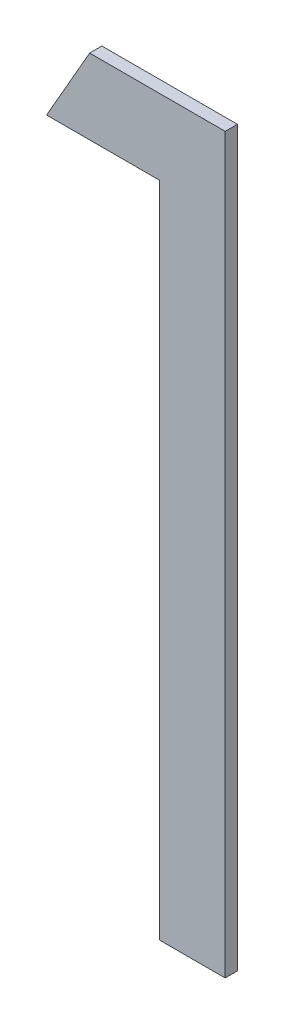
ISO-10303-21;
HEADER;
FILE_DESCRIPTION(('STEP AP214'),'2;1');
FILE_NAME('part.step','',(''),(''),'','','');
FILE_SCHEMA(('AUTOMOTIVE_DESIGN { 1 0 10303 214 1 1 1 1 }'));
ENDSEC;
DATA;
#1=APPLICATION_CONTEXT('core data for automotive mechanical design processes');
#2=APPLICATION_PROTOCOL_DEFINITION('international standard','automotive_design',2000,#1);
#3=PRODUCT_CONTEXT('',#1,'mechanical');
#4=PRODUCT('Part','Part','',(#3));
#5=PRODUCT_RELATED_PRODUCT_CATEGORY('part','',(#4));
#6=PRODUCT_DEFINITION_FORMATION('','',#4);
#7=PRODUCT_DEFINITION_CONTEXT('part definition',#1,'design');
#8=PRODUCT_DEFINITION('design','',#6,#7);
#9=PRODUCT_DEFINITION_SHAPE('','',#8);
#10=(LENGTH_UNIT() NAMED_UNIT(*) SI_UNIT(.MILLI.,.METRE.));
#11=(NAMED_UNIT(*) PLANE_ANGLE_UNIT() SI_UNIT($,.RADIAN.));
#12=(NAMED_UNIT(*) SI_UNIT($,.STERADIAN.) SOLID_ANGLE_UNIT());
#13=UNCERTAINTY_MEASURE_WITH_UNIT(LENGTH_MEASURE(1.E-05),#10,'distance_accuracy_value','');
#14=(GEOMETRIC_REPRESENTATION_CONTEXT(3) GLOBAL_UNCERTAINTY_ASSIGNED_CONTEXT((#13)) GLOBAL_UNIT_ASSIGNED_CONTEXT((#10,
#11,#12)) REPRESENTATION_CONTEXT('',''));
#15=CARTESIAN_POINT('',(0.,0.,0.));
#16=DIRECTION('',(0.,0.,1.));
#17=DIRECTION('',(1.,0.,0.));
#18=AXIS2_PLACEMENT_3D('',#15,#16,#17);
#19=CARTESIAN_POINT('',(1.23615384615385,0.24390475768074,0.551));
#20=DIRECTION('',(-0.86793001385971,0.496686511837681,0.));
#21=DIRECTION('',(-0.496686511837681,-0.86793001385971,0.));
#22=AXIS2_PLACEMENT_3D('',#19,#20,#21);
#23=PLANE('',#22);
#24=DIRECTION('',(0.496686511837677,0.867930013859713,0.));
#25=VECTOR('',#24,1.);
#26=CARTESIAN_POINT('',(1.23615384615385,0.24390475768074,0.55));
#27=LINE('',#26,#25);
#28=CARTESIAN_POINT('',(1.23615384615385,0.24390475768074,0.55));
#29=VERTEX_POINT('',#28);
#30=CARTESIAN_POINT('',(1.23967548076923,0.250058603834586,0.55));
#31=VERTEX_POINT('',#30);
#32=EDGE_CURVE('E11',#29,#31,#27,.T.);
#33=ORIENTED_EDGE('',*,*,#32,.F.);
#34=DIRECTION('',(0.,0.,-1.));
#35=VECTOR('',#34,1.);
#36=CARTESIAN_POINT('',(1.23615384615385,0.24390475768074,0.551));
#37=LINE('',#36,#35);
#38=CARTESIAN_POINT('',(1.23615384615385,0.24390475768074,0.551));
#39=VERTEX_POINT('',#38);
#40=EDGE_CURVE('E119',#39,#29,#37,.T.);
#41=ORIENTED_EDGE('',*,*,#40,.F.);
#42=DIRECTION('',(0.496686511837677,0.867930013859713,0.));
#43=VECTOR('',#42,1.);
#44=CARTESIAN_POINT('',(1.23615384615385,0.24390475768074,0.551));
#45=LINE('',#44,#43);
#46=CARTESIAN_POINT('',(1.23967548076923,0.250058603834586,0.551));
#47=VERTEX_POINT('',#46);
#48=EDGE_CURVE('E112',#39,#47,#45,.T.);
#49=ORIENTED_EDGE('',*,*,#48,.T.);
#50=DIRECTION('',(0.,0.,-1.));
#51=VECTOR('',#50,1.);
#52=CARTESIAN_POINT('',(1.23967548076923,0.250058603834586,0.551));
#53=LINE('',#52,#51);
#54=EDGE_CURVE('E85',#47,#31,#53,.T.);
#55=ORIENTED_EDGE('',*,*,#54,.T.);
#56=EDGE_LOOP('',(#33,#41,#49,#55));
#57=FACE_BOUND('',#56,.T.);
#58=ADVANCED_FACE('F17',(#57),#23,.T.);
#59=CARTESIAN_POINT('',(1.24538461538462,0.24390475768074,0.551));
#60=DIRECTION('',(0.,-1.,0.));
#61=DIRECTION('',(0.,0.,-1.));
#62=AXIS2_PLACEMENT_3D('',#59,#60,#61);
#63=PLANE('',#62);
#64=DIRECTION('',(-1.,0.,0.));
#65=VECTOR('',#64,1.);
#66=CARTESIAN_POINT('',(1.24538461538462,0.24390475768074,0.55));
#67=LINE('',#66,#65);
#68=CARTESIAN_POINT('',(1.24538461538462,0.24390475768074,0.55));
#69=VERTEX_POINT('',#68);
#70=EDGE_CURVE('E24',#69,#29,#67,.T.);
#71=ORIENTED_EDGE('',*,*,#70,.F.);
#72=DIRECTION('',(0.,0.,-1.));
#73=VECTOR('',#72,1.);
#74=CARTESIAN_POINT('',(1.24538461538462,0.24390475768074,0.551));
#75=LINE('',#74,#73);
#76=CARTESIAN_POINT('',(1.24538461538462,0.24390475768074,0.551));
#77=VERTEX_POINT('',#76);
#78=EDGE_CURVE('E114',#77,#69,#75,.T.);
#79=ORIENTED_EDGE('',*,*,#78,.F.);
#80=DIRECTION('',(-1.,0.,0.));
#81=VECTOR('',#80,1.);
#82=CARTESIAN_POINT('',(1.24538461538462,0.24390475768074,0.551));
#83=LINE('',#82,#81);
#84=EDGE_CURVE('E103',#77,#39,#83,.T.);
#85=ORIENTED_EDGE('',*,*,#84,.T.);
#86=ORIENTED_EDGE('',*,*,#40,.T.);
#87=EDGE_LOOP('',(#71,#79,#85,#86));
#88=FACE_BOUND('',#87,.T.);
#89=ADVANCED_FACE('F127',(#88),#63,.T.);
#90=CARTESIAN_POINT('',(1.24538461538462,0.190058603834586,0.551));
#91=DIRECTION('',(-1.,0.,0.));
#92=DIRECTION('',(0.,0.,1.));
#93=AXIS2_PLACEMENT_3D('',#90,#91,#92);
#94=PLANE('',#93);
#95=DIRECTION('',(0.,1.,0.));
#96=VECTOR('',#95,1.);
#97=CARTESIAN_POINT('',(1.24538461538462,0.190058603834586,0.55));
#98=LINE('',#97,#96);
#99=CARTESIAN_POINT('',(1.24538461538462,0.190058603834586,0.55));
#100=VERTEX_POINT('',#99);
#101=EDGE_CURVE('E116',#100,#69,#98,.T.);
#102=ORIENTED_EDGE('',*,*,#101,.F.);
#103=DIRECTION('',(0.,0.,-1.));
#104=VECTOR('',#103,1.);
#105=CARTESIAN_POINT('',(1.24538461538462,0.190058603834586,0.551));
#106=LINE('',#105,#104);
#107=CARTESIAN_POINT('',(1.24538461538462,0.190058603834586,0.551));
#108=VERTEX_POINT('',#107);
#109=EDGE_CURVE('E106',#108,#100,#106,.T.);
#110=ORIENTED_EDGE('',*,*,#109,.F.);
#111=DIRECTION('',(0.,1.,0.));
#112=VECTOR('',#111,1.);
#113=CARTESIAN_POINT('',(1.24538461538462,0.190058603834586,0.551));
#114=LINE('',#113,#112);
#115=EDGE_CURVE('E96',#108,#77,#114,.T.);
#116=ORIENTED_EDGE('',*,*,#115,.T.);
#117=ORIENTED_EDGE('',*,*,#78,.T.);
#118=EDGE_LOOP('',(#102,#110,#116,#117));
#119=FACE_BOUND('',#118,.T.);
#120=ADVANCED_FACE('F123',(#119),#94,.T.);
#121=CARTESIAN_POINT('',(1.25076923076923,0.190058603834586,0.551));
#122=DIRECTION('',(0.,-1.,0.));
#123=DIRECTION('',(0.,0.,-1.));
#124=AXIS2_PLACEMENT_3D('',#121,#122,#123);
#125=PLANE('',#124);
#126=DIRECTION('',(-1.,0.,0.));
#127=VECTOR('',#126,1.);
#128=CARTESIAN_POINT('',(1.25076923076923,0.190058603834586,0.55));
#129=LINE('',#128,#127);
#130=CARTESIAN_POINT('',(1.25076923076923,0.190058603834586,0.55));
#131=VERTEX_POINT('',#130);
#132=EDGE_CURVE('E109',#131,#100,#129,.T.);
#133=ORIENTED_EDGE('',*,*,#132,.F.);
#134=DIRECTION('',(0.,0.,-1.));
#135=VECTOR('',#134,1.);
#136=CARTESIAN_POINT('',(1.25076923076923,0.190058603834586,0.551));
#137=LINE('',#136,#135);
#138=CARTESIAN_POINT('',(1.25076923076923,0.190058603834586,0.551));
#139=VERTEX_POINT('',#138);
#140=EDGE_CURVE('E99',#139,#131,#137,.T.);
#141=ORIENTED_EDGE('',*,*,#140,.F.);
#142=DIRECTION('',(-1.,0.,0.));
#143=VECTOR('',#142,1.);
#144=CARTESIAN_POINT('',(1.25076923076923,0.190058603834586,0.551));
#145=LINE('',#144,#143);
#146=EDGE_CURVE('E79',#139,#108,#145,.T.);
#147=ORIENTED_EDGE('',*,*,#146,.T.);
#148=ORIENTED_EDGE('',*,*,#109,.T.);
#149=EDGE_LOOP('',(#133,#141,#147,#148));
#150=FACE_BOUND('',#149,.T.);
#151=ADVANCED_FACE('F125',(#150),#125,.T.);
#152=CARTESIAN_POINT('',(1.25076923076923,0.250058603834586,0.551));
#153=DIRECTION('',(1.,0.,0.));
#154=DIRECTION('',(0.,0.,-1.));
#155=AXIS2_PLACEMENT_3D('',#152,#153,#154);
#156=PLANE('',#155);
#157=DIRECTION('',(0.,-1.,0.));
#158=VECTOR('',#157,1.);
#159=CARTESIAN_POINT('',(1.25076923076923,0.250058603834586,0.55));
#160=LINE('',#159,#158);
#161=CARTESIAN_POINT('',(1.25076923076923,0.250058603834586,0.55));
#162=VERTEX_POINT('',#161);
#163=EDGE_CURVE('E74',#162,#131,#160,.T.);
#164=ORIENTED_EDGE('',*,*,#163,.F.);
#165=DIRECTION('',(0.,0.,-1.));
#166=VECTOR('',#165,1.);
#167=CARTESIAN_POINT('',(1.25076923076923,0.250058603834586,0.551));
#168=LINE('',#167,#166);
#169=CARTESIAN_POINT('',(1.25076923076923,0.250058603834586,0.551));
#170=VERTEX_POINT('',#169);
#171=EDGE_CURVE('E66',#170,#162,#168,.T.);
#172=ORIENTED_EDGE('',*,*,#171,.F.);
#173=DIRECTION('',(0.,-1.,0.));
#174=VECTOR('',#173,1.);
#175=CARTESIAN_POINT('',(1.25076923076923,0.250058603834586,0.551));
#176=LINE('',#175,#174);
#177=EDGE_CURVE('E71',#170,#139,#176,.T.);
#178=ORIENTED_EDGE('',*,*,#177,.T.);
#179=ORIENTED_EDGE('',*,*,#140,.T.);
#180=EDGE_LOOP('',(#164,#172,#178,#179));
#181=FACE_BOUND('',#180,.T.);
#182=ADVANCED_FACE('F68',(#181),#156,.T.);
#183=CARTESIAN_POINT('',(1.23967548076923,0.250058603834586,0.551));
#184=DIRECTION('',(0.,1.,0.));
#185=DIRECTION('',(0.,0.,1.));
#186=AXIS2_PLACEMENT_3D('',#183,#184,#185);
#187=PLANE('',#186);
#188=DIRECTION('',(1.,0.,0.));
#189=VECTOR('',#188,1.);
#190=CARTESIAN_POINT('',(1.23967548076923,0.250058603834586,0.55));
#191=LINE('',#190,#189);
#192=EDGE_CURVE('E78',#31,#162,#191,.T.);
#193=ORIENTED_EDGE('',*,*,#192,.F.);
#194=ORIENTED_EDGE('',*,*,#54,.F.);
#195=DIRECTION('',(1.,0.,0.));
#196=VECTOR('',#195,1.);
#197=CARTESIAN_POINT('',(1.23967548076923,0.250058603834586,0.551));
#198=LINE('',#197,#196);
#199=EDGE_CURVE('E83',#47,#170,#198,.T.);
#200=ORIENTED_EDGE('',*,*,#199,.T.);
#201=ORIENTED_EDGE('',*,*,#171,.T.);
#202=EDGE_LOOP('',(#193,#194,#200,#201));
#203=FACE_BOUND('',#202,.T.);
#204=ADVANCED_FACE('F84',(#203),#187,.T.);
#205=CARTESIAN_POINT('',(0.,0.,0.551));
#206=DIRECTION('',(0.,0.,-1.));
#207=DIRECTION('',(-1.,0.,0.));
#208=AXIS2_PLACEMENT_3D('',#205,#206,#207);
#209=PLANE('',#208);
#210=ORIENTED_EDGE('',*,*,#48,.F.);
#211=ORIENTED_EDGE('',*,*,#84,.F.);
#212=ORIENTED_EDGE('',*,*,#115,.F.);
#213=ORIENTED_EDGE('',*,*,#146,.F.);
#214=ORIENTED_EDGE('',*,*,#177,.F.);
#215=ORIENTED_EDGE('',*,*,#199,.F.);
#216=EDGE_LOOP('',(#210,#211,#212,#213,#214,#215));
#217=FACE_BOUND('',#216,.T.);
#218=ADVANCED_FACE('F89',(#217),#209,.F.);
#219=CARTESIAN_POINT('',(0.,0.,0.55));
#220=DIRECTION('',(0.,0.,-1.));
#221=DIRECTION('',(-1.,0.,0.));
#222=AXIS2_PLACEMENT_3D('',#219,#220,#221);
#223=PLANE('',#222);
#224=ORIENTED_EDGE('',*,*,#32,.T.);
#225=ORIENTED_EDGE('',*,*,#192,.T.);
#226=ORIENTED_EDGE('',*,*,#163,.T.);
#227=ORIENTED_EDGE('',*,*,#132,.T.);
#228=ORIENTED_EDGE('',*,*,#101,.T.);
#229=ORIENTED_EDGE('',*,*,#70,.T.);
#230=EDGE_LOOP('',(#224,#225,#226,#227,#228,#229));
#231=FACE_BOUND('',#230,.T.);
#232=ADVANCED_FACE('F121',(#231),#223,.T.);
#233=CLOSED_SHELL('',(#58,#89,#120,#151,#182,#204,#218,#232));
#234=MANIFOLD_SOLID_BREP('B1',#233);
#235=ADVANCED_BREP_SHAPE_REPRESENTATION('',(#18,#234),#14);
#236=SHAPE_DEFINITION_REPRESENTATION(#9,#235);
ENDSEC;
END-ISO-10303-21;
